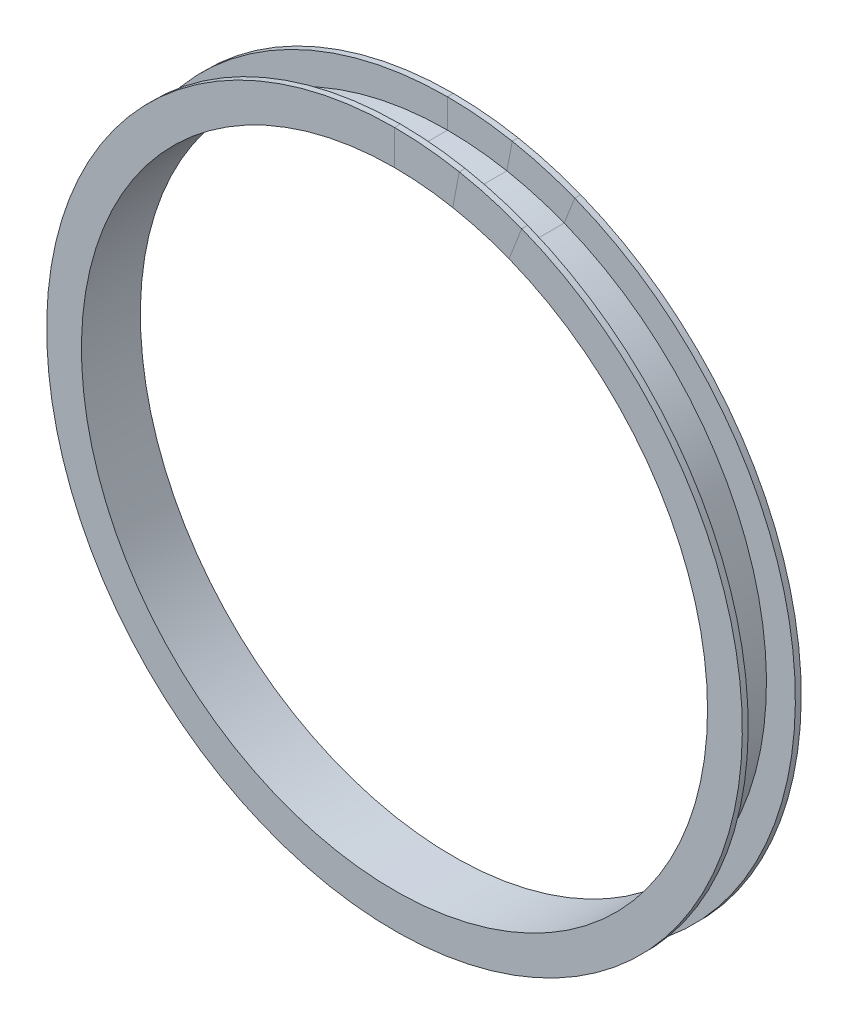
ISO-10303-21;
HEADER;
FILE_DESCRIPTION(('STEP AP214'),'2;1');
FILE_NAME('part.step','',(''),(''),'','','');
FILE_SCHEMA(('AUTOMOTIVE_DESIGN { 1 0 10303 214 1 1 1 1 }'));
ENDSEC;
DATA;
#1=APPLICATION_CONTEXT('core data for automotive mechanical design processes');
#2=APPLICATION_PROTOCOL_DEFINITION('international standard','automotive_design',2000,#1);
#3=PRODUCT_CONTEXT('',#1,'mechanical');
#4=PRODUCT('Part','Part','',(#3));
#5=PRODUCT_RELATED_PRODUCT_CATEGORY('part','',(#4));
#6=PRODUCT_DEFINITION_FORMATION('','',#4);
#7=PRODUCT_DEFINITION_CONTEXT('part definition',#1,'design');
#8=PRODUCT_DEFINITION('design','',#6,#7);
#9=PRODUCT_DEFINITION_SHAPE('','',#8);
#10=(LENGTH_UNIT() NAMED_UNIT(*) SI_UNIT(.MILLI.,.METRE.));
#11=(NAMED_UNIT(*) PLANE_ANGLE_UNIT() SI_UNIT($,.RADIAN.));
#12=(NAMED_UNIT(*) SI_UNIT($,.STERADIAN.) SOLID_ANGLE_UNIT());
#13=UNCERTAINTY_MEASURE_WITH_UNIT(LENGTH_MEASURE(1.E-05),#10,'distance_accuracy_value','');
#14=(GEOMETRIC_REPRESENTATION_CONTEXT(3) GLOBAL_UNCERTAINTY_ASSIGNED_CONTEXT((#13)) GLOBAL_UNIT_ASSIGNED_CONTEXT((#10,
#11,#12)) REPRESENTATION_CONTEXT('',''));
#15=CARTESIAN_POINT('',(0.,0.,0.));
#16=DIRECTION('',(0.,0.,1.));
#17=DIRECTION('',(1.,0.,0.));
#18=AXIS2_PLACEMENT_3D('',#15,#16,#17);
#19=CARTESIAN_POINT('',(0.,49.6794513874194,-0.01));
#20=DIRECTION('',(1.,0.,0.));
#21=DIRECTION('',(0.,1.,0.));
#22=AXIS2_PLACEMENT_3D('',#19,#20,#21);
#23=PLANE('',#22);
#24=DIRECTION('',(0.,0.,-1.));
#25=VECTOR('',#24,1.);
#26=CARTESIAN_POINT('',(0.,168.656,3.175));
#27=LINE('',#26,#25);
#28=CARTESIAN_POINT('',(0.,168.656,0.));
#29=VERTEX_POINT('',#28);
#30=CARTESIAN_POINT('',(0.,168.656,31.75));
#31=VERTEX_POINT('',#30);
#32=EDGE_CURVE('E154',#29,#31,#27,.F.);
#33=ORIENTED_EDGE('',*,*,#32,.T.);
#34=DIRECTION('',(0.,1.,0.));
#35=VECTOR('',#34,1.);
#36=CARTESIAN_POINT('',(0.,0.,31.75));
#37=LINE('',#36,#35);
#38=CARTESIAN_POINT('',(0.,187.3885,31.75));
#39=VERTEX_POINT('',#38);
#40=EDGE_CURVE('E50',#31,#39,#37,.T.);
#41=ORIENTED_EDGE('',*,*,#40,.T.);
#42=DIRECTION('',(0.,0.,-1.));
#43=VECTOR('',#42,1.);
#44=CARTESIAN_POINT('',(0.,187.3885,31.75));
#45=LINE('',#44,#43);
#46=CARTESIAN_POINT('',(0.,187.3885,28.575));
#47=VERTEX_POINT('',#46);
#48=EDGE_CURVE('E63',#47,#39,#45,.F.);
#49=ORIENTED_EDGE('',*,*,#48,.F.);
#50=DIRECTION('',(0.,1.,0.));
#51=VECTOR('',#50,1.);
#52=CARTESIAN_POINT('',(0.,0.,28.575));
#53=LINE('',#52,#51);
#54=CARTESIAN_POINT('',(0.,171.831,28.575));
#55=VERTEX_POINT('',#54);
#56=EDGE_CURVE('E71',#55,#47,#53,.T.);
#57=ORIENTED_EDGE('',*,*,#56,.F.);
#58=DIRECTION('',(0.,0.,-1.));
#59=VECTOR('',#58,1.);
#60=CARTESIAN_POINT('',(0.,171.831,28.575));
#61=LINE('',#60,#59);
#62=CARTESIAN_POINT('',(0.,171.831,3.175));
#63=VERTEX_POINT('',#62);
#64=EDGE_CURVE('E125',#63,#55,#61,.F.);
#65=ORIENTED_EDGE('',*,*,#64,.F.);
#66=DIRECTION('',(0.,1.,0.));
#67=VECTOR('',#66,1.);
#68=CARTESIAN_POINT('',(0.,0.,3.175));
#69=LINE('',#68,#67);
#70=CARTESIAN_POINT('',(0.,187.3885,3.175));
#71=VERTEX_POINT('',#70);
#72=EDGE_CURVE('E150',#63,#71,#69,.T.);
#73=ORIENTED_EDGE('',*,*,#72,.T.);
#74=DIRECTION('',(0.,0.,-1.));
#75=VECTOR('',#74,1.);
#76=CARTESIAN_POINT('',(0.,187.3885,3.175));
#77=LINE('',#76,#75);
#78=CARTESIAN_POINT('',(0.,187.3885,0.));
#79=VERTEX_POINT('',#78);
#80=EDGE_CURVE('E171',#79,#71,#77,.F.);
#81=ORIENTED_EDGE('',*,*,#80,.F.);
#82=DIRECTION('',(0.,1.,0.));
#83=VECTOR('',#82,1.);
#84=CARTESIAN_POINT('',(0.,0.,0.));
#85=LINE('',#84,#83);
#86=EDGE_CURVE('E169',#29,#79,#85,.T.);
#87=ORIENTED_EDGE('',*,*,#86,.F.);
#88=EDGE_LOOP('',(#33,#41,#49,#57,#65,#73,#81,#87));
#89=FACE_BOUND('',#88,.T.);
#90=ADVANCED_FACE('F46',(#89),#23,.F.);
#91=CARTESIAN_POINT('',(9.24937415001116,48.8108283886688,-0.01));
#92=DIRECTION('',(0.982515447041136,-0.186181084768449,0.));
#93=DIRECTION('',(0.186181084768449,0.982515447041136,0.));
#94=AXIS2_PLACEMENT_3D('',#91,#92,#93);
#95=PLANE('',#94);
#96=DIRECTION('',(0.,0.,-1.));
#97=VECTOR('',#96,1.);
#98=CARTESIAN_POINT('',(31.4005570327075,165.70712523617,3.175));
#99=LINE('',#98,#97);
#100=CARTESIAN_POINT('',(31.4005570327075,165.70712523617,0.));
#101=VERTEX_POINT('',#100);
#102=CARTESIAN_POINT('',(31.4005570327075,165.70712523617,31.75));
#103=VERTEX_POINT('',#102);
#104=EDGE_CURVE('E170',#101,#103,#99,.F.);
#105=ORIENTED_EDGE('',*,*,#104,.F.);
#106=DIRECTION('',(0.186181084768449,0.982515447041136,0.));
#107=VECTOR('',#106,1.);
#108=CARTESIAN_POINT('',(0.,0.,0.));
#109=LINE('',#108,#107);
#110=CARTESIAN_POINT('',(34.8881942031324,184.112095847868,0.));
#111=VERTEX_POINT('',#110);
#112=EDGE_CURVE('E153',#101,#111,#109,.T.);
#113=ORIENTED_EDGE('',*,*,#112,.T.);
#114=DIRECTION('',(0.,0.,-1.));
#115=VECTOR('',#114,1.);
#116=CARTESIAN_POINT('',(34.8881942031324,184.112095847868,3.175));
#117=LINE('',#116,#115);
#118=CARTESIAN_POINT('',(34.8881942031324,184.112095847868,3.175));
#119=VERTEX_POINT('',#118);
#120=EDGE_CURVE('E156',#111,#119,#117,.F.);
#121=ORIENTED_EDGE('',*,*,#120,.T.);
#122=DIRECTION('',(0.186181084768449,0.982515447041136,0.));
#123=VECTOR('',#122,1.);
#124=CARTESIAN_POINT('',(0.,0.,3.175));
#125=LINE('',#124,#123);
#126=CARTESIAN_POINT('',(31.9916819768473,168.826611780525,3.175));
#127=VERTEX_POINT('',#126);
#128=EDGE_CURVE('E152',#127,#119,#125,.T.);
#129=ORIENTED_EDGE('',*,*,#128,.F.);
#130=DIRECTION('',(0.,0.,-1.));
#131=VECTOR('',#130,1.);
#132=CARTESIAN_POINT('',(31.9916819768473,168.826611780525,28.575));
#133=LINE('',#132,#131);
#134=CARTESIAN_POINT('',(31.9916819768473,168.826611780526,28.575));
#135=VERTEX_POINT('',#134);
#136=EDGE_CURVE('E157',#127,#135,#133,.F.);
#137=ORIENTED_EDGE('',*,*,#136,.T.);
#138=DIRECTION('',(0.186181084768449,0.982515447041136,0.));
#139=VECTOR('',#138,1.);
#140=CARTESIAN_POINT('',(0.,0.,28.575));
#141=LINE('',#140,#139);
#142=CARTESIAN_POINT('',(34.8881942031324,184.112095847868,28.575));
#143=VERTEX_POINT('',#142);
#144=EDGE_CURVE('E131',#135,#143,#141,.T.);
#145=ORIENTED_EDGE('',*,*,#144,.T.);
#146=DIRECTION('',(0.,0.,-1.));
#147=VECTOR('',#146,1.);
#148=CARTESIAN_POINT('',(34.8881942031324,184.112095847868,31.75));
#149=LINE('',#148,#147);
#150=CARTESIAN_POINT('',(34.8881942031324,184.112095847868,31.75));
#151=VERTEX_POINT('',#150);
#152=EDGE_CURVE('E116',#143,#151,#149,.F.);
#153=ORIENTED_EDGE('',*,*,#152,.T.);
#154=DIRECTION('',(0.186181084768449,0.982515447041136,0.));
#155=VECTOR('',#154,1.);
#156=CARTESIAN_POINT('',(0.,0.,31.75));
#157=LINE('',#156,#155);
#158=EDGE_CURVE('E121',#103,#151,#157,.T.);
#159=ORIENTED_EDGE('',*,*,#158,.F.);
#160=EDGE_LOOP('',(#105,#113,#121,#129,#137,#145,#153,#159));
#161=FACE_BOUND('',#160,.T.);
#162=ADVANCED_FACE('F128',(#161),#95,.T.);
#163=CARTESIAN_POINT('',(0.,0.,3.175));
#164=DIRECTION('',(0.,0.,1.));
#165=DIRECTION('',(1.,0.,0.));
#166=AXIS2_PLACEMENT_3D('',#163,#164,#165);
#167=PLANE('',#166);
#168=ORIENTED_EDGE('',*,*,#72,.F.);
#169=CARTESIAN_POINT('',(0.,0.,3.175));
#170=DIRECTION('',(0.,0.,1.));
#171=DIRECTION('',(1.,0.,0.));
#172=AXIS2_PLACEMENT_3D('',#169,#170,#171);
#173=CIRCLE('',#172,171.831);
#174=EDGE_CURVE('E118',#127,#63,#173,.T.);
#175=ORIENTED_EDGE('',*,*,#174,.F.);
#176=ORIENTED_EDGE('',*,*,#128,.T.);
#177=CARTESIAN_POINT('',(0.,0.,3.175));
#178=DIRECTION('',(0.,0.,1.));
#179=DIRECTION('',(1.,0.,0.));
#180=AXIS2_PLACEMENT_3D('',#177,#178,#179);
#181=CIRCLE('',#180,187.3885);
#182=EDGE_CURVE('E147',#119,#71,#181,.T.);
#183=ORIENTED_EDGE('',*,*,#182,.T.);
#184=EDGE_LOOP('',(#168,#175,#176,#183));
#185=FACE_BOUND('',#184,.T.);
#186=ADVANCED_FACE('F203',(#185),#167,.T.);
#187=CARTESIAN_POINT('',(0.,0.,0.));
#188=DIRECTION('',(0.,0.,1.));
#189=DIRECTION('',(1.,0.,0.));
#190=AXIS2_PLACEMENT_3D('',#187,#188,#189);
#191=PLANE('',#190);
#192=CARTESIAN_POINT('',(0.,0.,0.));
#193=DIRECTION('',(0.,0.,1.));
#194=DIRECTION('',(1.,0.,0.));
#195=AXIS2_PLACEMENT_3D('',#192,#193,#194);
#196=CIRCLE('',#195,168.656);
#197=EDGE_CURVE('E141',#101,#29,#196,.T.);
#198=ORIENTED_EDGE('',*,*,#197,.T.);
#199=ORIENTED_EDGE('',*,*,#86,.T.);
#200=CARTESIAN_POINT('',(0.,0.,0.));
#201=DIRECTION('',(0.,0.,1.));
#202=DIRECTION('',(1.,0.,0.));
#203=AXIS2_PLACEMENT_3D('',#200,#201,#202);
#204=CIRCLE('',#203,187.3885);
#205=EDGE_CURVE('E144',#111,#79,#204,.T.);
#206=ORIENTED_EDGE('',*,*,#205,.F.);
#207=ORIENTED_EDGE('',*,*,#112,.F.);
#208=EDGE_LOOP('',(#198,#199,#206,#207));
#209=FACE_BOUND('',#208,.T.);
#210=ADVANCED_FACE('F179',(#209),#191,.F.);
#211=CARTESIAN_POINT('',(0.,0.,3.175));
#212=DIRECTION('',(0.,0.,-1.));
#213=DIRECTION('',(-1.,0.,0.));
#214=AXIS2_PLACEMENT_3D('',#211,#212,#213);
#215=CYLINDRICAL_SURFACE('',#214,187.3885);
#216=ORIENTED_EDGE('',*,*,#205,.T.);
#217=ORIENTED_EDGE('',*,*,#80,.T.);
#218=ORIENTED_EDGE('',*,*,#182,.F.);
#219=ORIENTED_EDGE('',*,*,#120,.F.);
#220=EDGE_LOOP('',(#216,#217,#218,#219));
#221=FACE_BOUND('',#220,.T.);
#222=ADVANCED_FACE('F185',(#221),#215,.T.);
#223=CARTESIAN_POINT('',(0.,0.,3.175));
#224=DIRECTION('',(0.,0.,-1.));
#225=DIRECTION('',(-1.,0.,0.));
#226=AXIS2_PLACEMENT_3D('',#223,#224,#225);
#227=CYLINDRICAL_SURFACE('',#226,168.656);
#228=ORIENTED_EDGE('',*,*,#32,.F.);
#229=ORIENTED_EDGE('',*,*,#197,.F.);
#230=ORIENTED_EDGE('',*,*,#104,.T.);
#231=CARTESIAN_POINT('',(0.,0.,31.75));
#232=DIRECTION('',(0.,0.,1.));
#233=DIRECTION('',(1.,0.,0.));
#234=AXIS2_PLACEMENT_3D('',#231,#232,#233);
#235=CIRCLE('',#234,168.656);
#236=EDGE_CURVE('E12',#103,#31,#235,.T.);
#237=ORIENTED_EDGE('',*,*,#236,.T.);
#238=EDGE_LOOP('',(#228,#229,#230,#237));
#239=FACE_BOUND('',#238,.T.);
#240=ADVANCED_FACE('F187',(#239),#227,.F.);
#241=CARTESIAN_POINT('',(0.,0.,28.575));
#242=DIRECTION('',(0.,0.,-1.));
#243=DIRECTION('',(-1.,0.,0.));
#244=AXIS2_PLACEMENT_3D('',#241,#242,#243);
#245=CYLINDRICAL_SURFACE('',#244,171.831);
#246=ORIENTED_EDGE('',*,*,#174,.T.);
#247=ORIENTED_EDGE('',*,*,#64,.T.);
#248=CARTESIAN_POINT('',(0.,0.,28.575));
#249=DIRECTION('',(0.,0.,1.));
#250=DIRECTION('',(1.,0.,0.));
#251=AXIS2_PLACEMENT_3D('',#248,#249,#250);
#252=CIRCLE('',#251,171.831);
#253=EDGE_CURVE('E139',#135,#55,#252,.T.);
#254=ORIENTED_EDGE('',*,*,#253,.F.);
#255=ORIENTED_EDGE('',*,*,#136,.F.);
#256=EDGE_LOOP('',(#246,#247,#254,#255));
#257=FACE_BOUND('',#256,.T.);
#258=ADVANCED_FACE('F189',(#257),#245,.T.);
#259=CARTESIAN_POINT('',(0.,0.,31.75));
#260=DIRECTION('',(0.,0.,1.));
#261=DIRECTION('',(1.,0.,0.));
#262=AXIS2_PLACEMENT_3D('',#259,#260,#261);
#263=PLANE('',#262);
#264=ORIENTED_EDGE('',*,*,#40,.F.);
#265=ORIENTED_EDGE('',*,*,#236,.F.);
#266=ORIENTED_EDGE('',*,*,#158,.T.);
#267=CARTESIAN_POINT('',(0.,0.,31.75));
#268=DIRECTION('',(0.,0.,1.));
#269=DIRECTION('',(1.,0.,0.));
#270=AXIS2_PLACEMENT_3D('',#267,#268,#269);
#271=CIRCLE('',#270,187.3885);
#272=EDGE_CURVE('E113',#151,#39,#271,.T.);
#273=ORIENTED_EDGE('',*,*,#272,.T.);
#274=EDGE_LOOP('',(#264,#265,#266,#273));
#275=FACE_BOUND('',#274,.T.);
#276=ADVANCED_FACE('F122',(#275),#263,.T.);
#277=CARTESIAN_POINT('',(0.,0.,28.575));
#278=DIRECTION('',(0.,0.,1.));
#279=DIRECTION('',(1.,0.,0.));
#280=AXIS2_PLACEMENT_3D('',#277,#278,#279);
#281=PLANE('',#280);
#282=ORIENTED_EDGE('',*,*,#253,.T.);
#283=ORIENTED_EDGE('',*,*,#56,.T.);
#284=CARTESIAN_POINT('',(0.,0.,28.575));
#285=DIRECTION('',(0.,0.,1.));
#286=DIRECTION('',(1.,0.,0.));
#287=AXIS2_PLACEMENT_3D('',#284,#285,#286);
#288=CIRCLE('',#287,187.3885);
#289=EDGE_CURVE('E55',#143,#47,#288,.T.);
#290=ORIENTED_EDGE('',*,*,#289,.F.);
#291=ORIENTED_EDGE('',*,*,#144,.F.);
#292=EDGE_LOOP('',(#282,#283,#290,#291));
#293=FACE_BOUND('',#292,.T.);
#294=ADVANCED_FACE('F239',(#293),#281,.F.);
#295=CARTESIAN_POINT('',(0.,0.,31.75));
#296=DIRECTION('',(0.,0.,-1.));
#297=DIRECTION('',(-1.,0.,0.));
#298=AXIS2_PLACEMENT_3D('',#295,#296,#297);
#299=CYLINDRICAL_SURFACE('',#298,187.3885);
#300=ORIENTED_EDGE('',*,*,#289,.T.);
#301=ORIENTED_EDGE('',*,*,#48,.T.);
#302=ORIENTED_EDGE('',*,*,#272,.F.);
#303=ORIENTED_EDGE('',*,*,#152,.F.);
#304=EDGE_LOOP('',(#300,#301,#302,#303));
#305=FACE_BOUND('',#304,.T.);
#306=ADVANCED_FACE('F48',(#305),#299,.T.);
#307=CLOSED_SHELL('',(#90,#162,#186,#210,#222,#240,#258,#276,#294,#306));
#308=MANIFOLD_SOLID_BREP('B2',#307);
#309=CARTESIAN_POINT('',(18.1753059556979,46.2353343620628,-0.01));
#310=DIRECTION('',(0.930673207348878,-0.365851583463775,0.));
#311=DIRECTION('',(0.365851583463775,0.930673207348878,0.));
#312=AXIS2_PLACEMENT_3D('',#309,#310,#311);
#313=PLANE('',#312);
#314=DIRECTION('',(0.,0.,-1.));
#315=VECTOR('',#314,1.);
#316=CARTESIAN_POINT('',(61.7030646606653,156.963620458633,3.175));
#317=LINE('',#316,#315);
#318=CARTESIAN_POINT('',(61.7030646606653,156.963620458633,0.));
#319=VERTEX_POINT('',#318);
#320=CARTESIAN_POINT('',(61.7030646606653,156.963620458633,31.75));
#321=VERTEX_POINT('',#320);
#322=EDGE_CURVE('E382',#319,#321,#317,.F.);
#323=ORIENTED_EDGE('',*,*,#322,.T.);
#324=DIRECTION('',(0.365851583463775,0.930673207348878,0.));
#325=VECTOR('',#324,1.);
#326=CARTESIAN_POINT('',(-1.15918275477802E-12,4.55679655340572E-13,31.75));
#327=LINE('',#326,#325);
#328=CARTESIAN_POINT('',(68.5563794479005,174.397456315296,31.75));
#329=VERTEX_POINT('',#328);
#330=EDGE_CURVE('E374',#321,#329,#327,.T.);
#331=ORIENTED_EDGE('',*,*,#330,.T.);
#332=DIRECTION('',(0.,0.,-1.));
#333=VECTOR('',#332,1.);
#334=CARTESIAN_POINT('',(68.5563794479005,174.397456315296,31.75));
#335=LINE('',#334,#333);
#336=CARTESIAN_POINT('',(68.5563794479005,174.397456315296,28.575));
#337=VERTEX_POINT('',#336);
#338=EDGE_CURVE('E306',#337,#329,#335,.F.);
#339=ORIENTED_EDGE('',*,*,#338,.F.);
#340=DIRECTION('',(0.365851583463775,0.930673207348878,0.));
#341=VECTOR('',#340,1.);
#342=CARTESIAN_POINT('',(-1.15918275477802E-12,4.55679655340572E-13,28.575));
#343=LINE('',#342,#341);
#344=CARTESIAN_POINT('',(62.8646434381628,159.918507891966,28.575));
#345=VERTEX_POINT('',#344);
#346=EDGE_CURVE('E314',#345,#337,#343,.T.);
#347=ORIENTED_EDGE('',*,*,#346,.F.);
#348=DIRECTION('',(0.,0.,-1.));
#349=VECTOR('',#348,1.);
#350=CARTESIAN_POINT('',(62.8646434381628,159.918507891966,28.575));
#351=LINE('',#350,#349);
#352=CARTESIAN_POINT('',(62.8646434381628,159.918507891966,3.175));
#353=VERTEX_POINT('',#352);
#354=EDGE_CURVE('E367',#353,#345,#351,.F.);
#355=ORIENTED_EDGE('',*,*,#354,.F.);
#356=DIRECTION('',(0.365851583463775,0.930673207348878,0.));
#357=VECTOR('',#356,1.);
#358=CARTESIAN_POINT('',(-1.15918275477802E-12,4.55679655340572E-13,3.175));
#359=LINE('',#358,#357);
#360=CARTESIAN_POINT('',(68.5563794479005,174.397456315296,3.175));
#361=VERTEX_POINT('',#360);
#362=EDGE_CURVE('E389',#353,#361,#359,.T.);
#363=ORIENTED_EDGE('',*,*,#362,.T.);
#364=DIRECTION('',(0.,0.,-1.));
#365=VECTOR('',#364,1.);
#366=CARTESIAN_POINT('',(68.5563794479005,174.397456315296,3.175));
#367=LINE('',#366,#365);
#368=CARTESIAN_POINT('',(68.5563794479005,174.397456315296,0.));
#369=VERTEX_POINT('',#368);
#370=EDGE_CURVE('E394',#369,#361,#367,.F.);
#371=ORIENTED_EDGE('',*,*,#370,.F.);
#372=DIRECTION('',(0.365851583463775,0.930673207348878,0.));
#373=VECTOR('',#372,1.);
#374=CARTESIAN_POINT('',(-1.15918275477802E-12,4.55679655340572E-13,0.));
#375=LINE('',#374,#373);
#376=EDGE_CURVE('E392',#319,#369,#375,.T.);
#377=ORIENTED_EDGE('',*,*,#376,.F.);
#378=EDGE_LOOP('',(#323,#331,#339,#347,#355,#363,#371,#377));
#379=FACE_BOUND('',#378,.T.);
#380=ADVANCED_FACE('F289',(#379),#313,.F.);
#381=CARTESIAN_POINT('',(0.,49.6794513874194,-0.01));
#382=DIRECTION('',(1.,0.,0.));
#383=DIRECTION('',(0.,1.,0.));
#384=AXIS2_PLACEMENT_3D('',#381,#382,#383);
#385=PLANE('',#384);
#386=DIRECTION('',(0.,0.,-1.));
#387=VECTOR('',#386,1.);
#388=CARTESIAN_POINT('',(0.,168.656,3.175));
#389=LINE('',#388,#387);
#390=CARTESIAN_POINT('',(0.,168.656,0.));
#391=VERTEX_POINT('',#390);
#392=CARTESIAN_POINT('',(0.,168.656,31.75));
#393=VERTEX_POINT('',#392);
#394=EDGE_CURVE('E393',#391,#393,#389,.F.);
#395=ORIENTED_EDGE('',*,*,#394,.F.);
#396=DIRECTION('',(0.,1.,0.));
#397=VECTOR('',#396,1.);
#398=CARTESIAN_POINT('',(0.,0.,0.));
#399=LINE('',#398,#397);
#400=CARTESIAN_POINT('',(0.,187.3885,0.));
#401=VERTEX_POINT('',#400);
#402=EDGE_CURVE('E386',#391,#401,#399,.T.);
#403=ORIENTED_EDGE('',*,*,#402,.T.);
#404=DIRECTION('',(0.,0.,-1.));
#405=VECTOR('',#404,1.);
#406=CARTESIAN_POINT('',(0.,187.3885,3.175));
#407=LINE('',#406,#405);
#408=CARTESIAN_POINT('',(0.,187.3885,3.175));
#409=VERTEX_POINT('',#408);
#410=EDGE_CURVE('E383',#401,#409,#407,.F.);
#411=ORIENTED_EDGE('',*,*,#410,.T.);
#412=DIRECTION('',(0.,1.,0.));
#413=VECTOR('',#412,1.);
#414=CARTESIAN_POINT('',(0.,0.,3.175));
#415=LINE('',#414,#413);
#416=CARTESIAN_POINT('',(0.,171.831,3.175));
#417=VERTEX_POINT('',#416);
#418=EDGE_CURVE('E390',#417,#409,#415,.T.);
#419=ORIENTED_EDGE('',*,*,#418,.F.);
#420=DIRECTION('',(0.,0.,-1.));
#421=VECTOR('',#420,1.);
#422=CARTESIAN_POINT('',(0.,171.831,28.575));
#423=LINE('',#422,#421);
#424=CARTESIAN_POINT('',(0.,171.831,28.575));
#425=VERTEX_POINT('',#424);
#426=EDGE_CURVE('E380',#417,#425,#423,.F.);
#427=ORIENTED_EDGE('',*,*,#426,.T.);
#428=DIRECTION('',(0.,1.,0.));
#429=VECTOR('',#428,1.);
#430=CARTESIAN_POINT('',(0.,0.,28.575));
#431=LINE('',#430,#429);
#432=CARTESIAN_POINT('',(0.,187.3885,28.575));
#433=VERTEX_POINT('',#432);
#434=EDGE_CURVE('E372',#425,#433,#431,.T.);
#435=ORIENTED_EDGE('',*,*,#434,.T.);
#436=DIRECTION('',(0.,0.,-1.));
#437=VECTOR('',#436,1.);
#438=CARTESIAN_POINT('',(0.,187.3885,31.75));
#439=LINE('',#438,#437);
#440=CARTESIAN_POINT('',(0.,187.3885,31.75));
#441=VERTEX_POINT('',#440);
#442=EDGE_CURVE('E359',#433,#441,#439,.F.);
#443=ORIENTED_EDGE('',*,*,#442,.T.);
#444=DIRECTION('',(0.,1.,0.));
#445=VECTOR('',#444,1.);
#446=CARTESIAN_POINT('',(0.,0.,31.75));
#447=LINE('',#446,#445);
#448=EDGE_CURVE('E293',#393,#441,#447,.T.);
#449=ORIENTED_EDGE('',*,*,#448,.F.);
#450=EDGE_LOOP('',(#395,#403,#411,#419,#427,#435,#443,#449));
#451=FACE_BOUND('',#450,.T.);
#452=ADVANCED_FACE('F369',(#451),#385,.T.);
#453=CARTESIAN_POINT('',(0.,0.,0.));
#454=DIRECTION('',(0.,0.,1.));
#455=DIRECTION('',(1.,0.,0.));
#456=AXIS2_PLACEMENT_3D('',#453,#454,#455);
#457=PLANE('',#456);
#458=ORIENTED_EDGE('',*,*,#402,.F.);
#459=CARTESIAN_POINT('',(0.,0.,0.));
#460=DIRECTION('',(0.,0.,1.));
#461=DIRECTION('',(1.,0.,0.));
#462=AXIS2_PLACEMENT_3D('',#459,#460,#461);
#463=CIRCLE('',#462,168.656);
#464=EDGE_CURVE('E415',#391,#319,#463,.T.);
#465=ORIENTED_EDGE('',*,*,#464,.T.);
#466=ORIENTED_EDGE('',*,*,#376,.T.);
#467=CARTESIAN_POINT('',(0.,0.,0.));
#468=DIRECTION('',(0.,0.,1.));
#469=DIRECTION('',(1.,0.,0.));
#470=AXIS2_PLACEMENT_3D('',#467,#468,#469);
#471=CIRCLE('',#470,187.3885);
#472=EDGE_CURVE('E417',#401,#369,#471,.T.);
#473=ORIENTED_EDGE('',*,*,#472,.F.);
#474=EDGE_LOOP('',(#458,#465,#466,#473));
#475=FACE_BOUND('',#474,.T.);
#476=ADVANCED_FACE('F429',(#475),#457,.F.);
#477=CARTESIAN_POINT('',(0.,0.,3.175));
#478=DIRECTION('',(0.,0.,1.));
#479=DIRECTION('',(1.,0.,0.));
#480=AXIS2_PLACEMENT_3D('',#477,#478,#479);
#481=PLANE('',#480);
#482=CARTESIAN_POINT('',(0.,0.,3.175));
#483=DIRECTION('',(0.,0.,1.));
#484=DIRECTION('',(1.,0.,0.));
#485=AXIS2_PLACEMENT_3D('',#482,#483,#484);
#486=CIRCLE('',#485,171.831);
#487=EDGE_CURVE('E361',#417,#353,#486,.T.);
#488=ORIENTED_EDGE('',*,*,#487,.F.);
#489=ORIENTED_EDGE('',*,*,#418,.T.);
#490=CARTESIAN_POINT('',(0.,0.,3.175));
#491=DIRECTION('',(0.,0.,1.));
#492=DIRECTION('',(1.,0.,0.));
#493=AXIS2_PLACEMENT_3D('',#490,#491,#492);
#494=CIRCLE('',#493,187.3885);
#495=EDGE_CURVE('E377',#409,#361,#494,.T.);
#496=ORIENTED_EDGE('',*,*,#495,.T.);
#497=ORIENTED_EDGE('',*,*,#362,.F.);
#498=EDGE_LOOP('',(#488,#489,#496,#497));
#499=FACE_BOUND('',#498,.T.);
#500=ADVANCED_FACE('F422',(#499),#481,.T.);
#501=CARTESIAN_POINT('',(0.,0.,3.175));
#502=DIRECTION('',(0.,0.,-1.));
#503=DIRECTION('',(-1.,0.,0.));
#504=AXIS2_PLACEMENT_3D('',#501,#502,#503);
#505=CYLINDRICAL_SURFACE('',#504,168.656);
#506=ORIENTED_EDGE('',*,*,#464,.F.);
#507=ORIENTED_EDGE('',*,*,#394,.T.);
#508=CARTESIAN_POINT('',(0.,0.,31.75));
#509=DIRECTION('',(0.,0.,1.));
#510=DIRECTION('',(1.,0.,0.));
#511=AXIS2_PLACEMENT_3D('',#508,#509,#510);
#512=CIRCLE('',#511,168.656);
#513=EDGE_CURVE('E44',#393,#321,#512,.T.);
#514=ORIENTED_EDGE('',*,*,#513,.T.);
#515=ORIENTED_EDGE('',*,*,#322,.F.);
#516=EDGE_LOOP('',(#506,#507,#514,#515));
#517=FACE_BOUND('',#516,.T.);
#518=ADVANCED_FACE('F431',(#517),#505,.F.);
#519=CARTESIAN_POINT('',(0.,0.,28.575));
#520=DIRECTION('',(0.,0.,-1.));
#521=DIRECTION('',(-1.,0.,0.));
#522=AXIS2_PLACEMENT_3D('',#519,#520,#521);
#523=CYLINDRICAL_SURFACE('',#522,171.831);
#524=ORIENTED_EDGE('',*,*,#426,.F.);
#525=ORIENTED_EDGE('',*,*,#487,.T.);
#526=ORIENTED_EDGE('',*,*,#354,.T.);
#527=CARTESIAN_POINT('',(0.,0.,28.575));
#528=DIRECTION('',(0.,0.,1.));
#529=DIRECTION('',(1.,0.,0.));
#530=AXIS2_PLACEMENT_3D('',#527,#528,#529);
#531=CIRCLE('',#530,171.831);
#532=EDGE_CURVE('E413',#425,#345,#531,.T.);
#533=ORIENTED_EDGE('',*,*,#532,.F.);
#534=EDGE_LOOP('',(#524,#525,#526,#533));
#535=FACE_BOUND('',#534,.T.);
#536=ADVANCED_FACE('F434',(#535),#523,.T.);
#537=CARTESIAN_POINT('',(0.,0.,31.75));
#538=DIRECTION('',(0.,0.,1.));
#539=DIRECTION('',(1.,0.,0.));
#540=AXIS2_PLACEMENT_3D('',#537,#538,#539);
#541=PLANE('',#540);
#542=ORIENTED_EDGE('',*,*,#513,.F.);
#543=ORIENTED_EDGE('',*,*,#448,.T.);
#544=CARTESIAN_POINT('',(0.,0.,31.75));
#545=DIRECTION('',(0.,0.,1.));
#546=DIRECTION('',(1.,0.,0.));
#547=AXIS2_PLACEMENT_3D('',#544,#545,#546);
#548=CIRCLE('',#547,187.3885);
#549=EDGE_CURVE('E356',#441,#329,#548,.T.);
#550=ORIENTED_EDGE('',*,*,#549,.T.);
#551=ORIENTED_EDGE('',*,*,#330,.F.);
#552=EDGE_LOOP('',(#542,#543,#550,#551));
#553=FACE_BOUND('',#552,.T.);
#554=ADVANCED_FACE('F364',(#553),#541,.T.);
#555=CARTESIAN_POINT('',(0.,0.,28.575));
#556=DIRECTION('',(0.,0.,1.));
#557=DIRECTION('',(1.,0.,0.));
#558=AXIS2_PLACEMENT_3D('',#555,#556,#557);
#559=PLANE('',#558);
#560=ORIENTED_EDGE('',*,*,#434,.F.);
#561=ORIENTED_EDGE('',*,*,#532,.T.);
#562=ORIENTED_EDGE('',*,*,#346,.T.);
#563=CARTESIAN_POINT('',(0.,0.,28.575));
#564=DIRECTION('',(0.,0.,1.));
#565=DIRECTION('',(1.,0.,0.));
#566=AXIS2_PLACEMENT_3D('',#563,#564,#565);
#567=CIRCLE('',#566,187.3885);
#568=EDGE_CURVE('E298',#433,#337,#567,.T.);
#569=ORIENTED_EDGE('',*,*,#568,.F.);
#570=EDGE_LOOP('',(#560,#561,#562,#569));
#571=FACE_BOUND('',#570,.T.);
#572=ADVANCED_FACE('F435',(#571),#559,.F.);
#573=CARTESIAN_POINT('',(0.,0.,31.75));
#574=DIRECTION('',(0.,0.,-1.));
#575=DIRECTION('',(-1.,0.,0.));
#576=AXIS2_PLACEMENT_3D('',#573,#574,#575);
#577=CYLINDRICAL_SURFACE('',#576,187.3885);
#578=ORIENTED_EDGE('',*,*,#442,.F.);
#579=ORIENTED_EDGE('',*,*,#568,.T.);
#580=ORIENTED_EDGE('',*,*,#338,.T.);
#581=ORIENTED_EDGE('',*,*,#549,.F.);
#582=EDGE_LOOP('',(#578,#579,#580,#581));
#583=FACE_BOUND('',#582,.T.);
#584=ADVANCED_FACE('F291',(#583),#577,.T.);
#585=CARTESIAN_POINT('',(0.,0.,3.175));
#586=DIRECTION('',(0.,0.,-1.));
#587=DIRECTION('',(-1.,0.,0.));
#588=AXIS2_PLACEMENT_3D('',#585,#586,#587);
#589=CYLINDRICAL_SURFACE('',#588,187.3885);
#590=ORIENTED_EDGE('',*,*,#410,.F.);
#591=ORIENTED_EDGE('',*,*,#472,.T.);
#592=ORIENTED_EDGE('',*,*,#370,.T.);
#593=ORIENTED_EDGE('',*,*,#495,.F.);
#594=EDGE_LOOP('',(#590,#591,#592,#593));
#595=FACE_BOUND('',#594,.T.);
#596=ADVANCED_FACE('F425',(#595),#589,.T.);
#597=CLOSED_SHELL('',(#380,#452,#476,#500,#518,#536,#554,#572,#584,#596));
#598=MANIFOLD_SOLID_BREP('B6',#597);
#599=CARTESIAN_POINT('',(9.24937415001116,48.8108283886688,-0.01));
#600=DIRECTION('',(0.982515447041136,-0.186181084768449,0.));
#601=DIRECTION('',(0.186181084768449,0.982515447041136,0.));
#602=AXIS2_PLACEMENT_3D('',#599,#600,#601);
#603=PLANE('',#602);
#604=DIRECTION('',(0.,0.,-1.));
#605=VECTOR('',#604,1.);
#606=CARTESIAN_POINT('',(31.4005570327075,165.70712523617,3.175));
#607=LINE('',#606,#605);
#608=CARTESIAN_POINT('',(31.4005570327075,165.70712523617,0.));
#609=VERTEX_POINT('',#608);
#610=CARTESIAN_POINT('',(31.4005570327075,165.70712523617,31.75));
#611=VERTEX_POINT('',#610);
#612=EDGE_CURVE('E527',#609,#611,#607,.F.);
#613=ORIENTED_EDGE('',*,*,#612,.T.);
#614=DIRECTION('',(0.186181084768449,0.982515447041136,0.));
#615=VECTOR('',#614,1.);
#616=CARTESIAN_POINT('',(0.,0.,31.75));
#617=LINE('',#616,#615);
#618=CARTESIAN_POINT('',(34.8881942031324,184.112095847868,31.75));
#619=VERTEX_POINT('',#618);
#620=EDGE_CURVE('E599',#611,#619,#617,.T.);
#621=ORIENTED_EDGE('',*,*,#620,.T.);
#622=DIRECTION('',(0.,0.,-1.));
#623=VECTOR('',#622,1.);
#624=CARTESIAN_POINT('',(34.8881942031324,184.112095847868,31.75));
#625=LINE('',#624,#623);
#626=CARTESIAN_POINT('',(34.8881942031324,184.112095847868,28.575));
#627=VERTEX_POINT('',#626);
#628=EDGE_CURVE('E590',#627,#619,#625,.F.);
#629=ORIENTED_EDGE('',*,*,#628,.F.);
#630=DIRECTION('',(0.186181084768449,0.982515447041136,0.));
#631=VECTOR('',#630,1.);
#632=CARTESIAN_POINT('',(0.,0.,28.575));
#633=LINE('',#632,#631);
#634=CARTESIAN_POINT('',(31.9916819768473,168.826611780526,28.575));
#635=VERTEX_POINT('',#634);
#636=EDGE_CURVE('E595',#635,#627,#633,.T.);
#637=ORIENTED_EDGE('',*,*,#636,.F.);
#638=DIRECTION('',(0.,0.,-1.));
#639=VECTOR('',#638,1.);
#640=CARTESIAN_POINT('',(31.9916819768473,168.826611780525,28.575));
#641=LINE('',#640,#639);
#642=CARTESIAN_POINT('',(31.9916819768473,168.826611780525,3.175));
#643=VERTEX_POINT('',#642);
#644=EDGE_CURVE('E627',#643,#635,#641,.F.);
#645=ORIENTED_EDGE('',*,*,#644,.F.);
#646=DIRECTION('',(0.186181084768449,0.982515447041136,0.));
#647=VECTOR('',#646,1.);
#648=CARTESIAN_POINT('',(0.,0.,3.175));
#649=LINE('',#648,#647);
#650=CARTESIAN_POINT('',(34.8881942031324,184.112095847868,3.175));
#651=VERTEX_POINT('',#650);
#652=EDGE_CURVE('E635',#643,#651,#649,.T.);
#653=ORIENTED_EDGE('',*,*,#652,.T.);
#654=DIRECTION('',(0.,0.,-1.));
#655=VECTOR('',#654,1.);
#656=CARTESIAN_POINT('',(34.8881942031324,184.112095847868,3.175));
#657=LINE('',#656,#655);
#658=CARTESIAN_POINT('',(34.8881942031324,184.112095847868,0.));
#659=VERTEX_POINT('',#658);
#660=EDGE_CURVE('E646',#659,#651,#657,.F.);
#661=ORIENTED_EDGE('',*,*,#660,.F.);
#662=DIRECTION('',(0.186181084768449,0.982515447041136,0.));
#663=VECTOR('',#662,1.);
#664=CARTESIAN_POINT('',(0.,0.,0.));
#665=LINE('',#664,#663);
#666=EDGE_CURVE('E636',#609,#659,#665,.T.);
#667=ORIENTED_EDGE('',*,*,#666,.F.);
#668=EDGE_LOOP('',(#613,#621,#629,#637,#645,#653,#661,#667));
#669=FACE_BOUND('',#668,.T.);
#670=ADVANCED_FACE('F523',(#669),#603,.F.);
#671=CARTESIAN_POINT('',(18.1753059556979,46.2353343620628,-0.01));
#672=DIRECTION('',(0.930673207348878,-0.365851583463775,0.));
#673=DIRECTION('',(0.365851583463775,0.930673207348878,0.));
#674=AXIS2_PLACEMENT_3D('',#671,#672,#673);
#675=PLANE('',#674);
#676=DIRECTION('',(0.,0.,-1.));
#677=VECTOR('',#676,1.);
#678=CARTESIAN_POINT('',(61.7030646606653,156.963620458633,3.175));
#679=LINE('',#678,#677);
#680=CARTESIAN_POINT('',(61.7030646606653,156.963620458633,0.));
#681=VERTEX_POINT('',#680);
#682=CARTESIAN_POINT('',(61.7030646606653,156.963620458633,31.75));
#683=VERTEX_POINT('',#682);
#684=EDGE_CURVE('E643',#681,#683,#679,.F.);
#685=ORIENTED_EDGE('',*,*,#684,.F.);
#686=DIRECTION('',(0.365851583463775,0.930673207348878,0.));
#687=VECTOR('',#686,1.);
#688=CARTESIAN_POINT('',(-1.15918275477802E-12,4.55679655340572E-13,0.));
#689=LINE('',#688,#687);
#690=CARTESIAN_POINT('',(68.5563794479005,174.397456315296,0.));
#691=VERTEX_POINT('',#690);
#692=EDGE_CURVE('E640',#681,#691,#689,.T.);
#693=ORIENTED_EDGE('',*,*,#692,.T.);
#694=DIRECTION('',(0.,0.,-1.));
#695=VECTOR('',#694,1.);
#696=CARTESIAN_POINT('',(68.5563794479005,174.397456315296,3.175));
#697=LINE('',#696,#695);
#698=CARTESIAN_POINT('',(68.5563794479005,174.397456315296,3.175));
#699=VERTEX_POINT('',#698);
#700=EDGE_CURVE('E637',#691,#699,#697,.F.);
#701=ORIENTED_EDGE('',*,*,#700,.T.);
#702=DIRECTION('',(0.365851583463775,0.930673207348878,0.));
#703=VECTOR('',#702,1.);
#704=CARTESIAN_POINT('',(-1.15918275477802E-12,4.55679655340572E-13,3.175));
#705=LINE('',#704,#703);
#706=CARTESIAN_POINT('',(62.8646434381628,159.918507891966,3.175));
#707=VERTEX_POINT('',#706);
#708=EDGE_CURVE('E632',#707,#699,#705,.T.);
#709=ORIENTED_EDGE('',*,*,#708,.F.);
#710=DIRECTION('',(0.,0.,-1.));
#711=VECTOR('',#710,1.);
#712=CARTESIAN_POINT('',(62.8646434381628,159.918507891966,28.575));
#713=LINE('',#712,#711);
#714=CARTESIAN_POINT('',(62.8646434381628,159.918507891966,28.575));
#715=VERTEX_POINT('',#714);
#716=EDGE_CURVE('E604',#707,#715,#713,.F.);
#717=ORIENTED_EDGE('',*,*,#716,.T.);
#718=DIRECTION('',(0.365851583463775,0.930673207348878,0.));
#719=VECTOR('',#718,1.);
#720=CARTESIAN_POINT('',(-1.15918275477802E-12,4.55679655340572E-13,28.575));
#721=LINE('',#720,#719);
#722=CARTESIAN_POINT('',(68.5563794479005,174.397456315296,28.575));
#723=VERTEX_POINT('',#722);
#724=EDGE_CURVE('E532',#715,#723,#721,.T.);
#725=ORIENTED_EDGE('',*,*,#724,.T.);
#726=DIRECTION('',(0.,0.,-1.));
#727=VECTOR('',#726,1.);
#728=CARTESIAN_POINT('',(68.5563794479005,174.397456315296,31.75));
#729=LINE('',#728,#727);
#730=CARTESIAN_POINT('',(68.5563794479005,174.397456315296,31.75));
#731=VERTEX_POINT('',#730);
#732=EDGE_CURVE('E287',#723,#731,#729,.F.);
#733=ORIENTED_EDGE('',*,*,#732,.T.);
#734=DIRECTION('',(0.365851583463775,0.930673207348878,0.));
#735=VECTOR('',#734,1.);
#736=CARTESIAN_POINT('',(-1.15918275477802E-12,4.55679655340572E-13,31.75));
#737=LINE('',#736,#735);
#738=EDGE_CURVE('E607',#683,#731,#737,.T.);
#739=ORIENTED_EDGE('',*,*,#738,.F.);
#740=EDGE_LOOP('',(#685,#693,#701,#709,#717,#725,#733,#739));
#741=FACE_BOUND('',#740,.T.);
#742=ADVANCED_FACE('F525',(#741),#675,.T.);
#743=CARTESIAN_POINT('',(0.,0.,0.));
#744=DIRECTION('',(0.,0.,1.));
#745=DIRECTION('',(1.,0.,0.));
#746=AXIS2_PLACEMENT_3D('',#743,#744,#745);
#747=PLANE('',#746);
#748=CARTESIAN_POINT('',(0.,0.,0.));
#749=DIRECTION('',(0.,0.,1.));
#750=DIRECTION('',(1.,0.,0.));
#751=AXIS2_PLACEMENT_3D('',#748,#749,#750);
#752=CIRCLE('',#751,168.656);
#753=EDGE_CURVE('E618',#681,#609,#752,.T.);
#754=ORIENTED_EDGE('',*,*,#753,.T.);
#755=ORIENTED_EDGE('',*,*,#666,.T.);
#756=CARTESIAN_POINT('',(0.,0.,0.));
#757=DIRECTION('',(0.,0.,1.));
#758=DIRECTION('',(1.,0.,0.));
#759=AXIS2_PLACEMENT_3D('',#756,#757,#758);
#760=CIRCLE('',#759,187.3885);
#761=EDGE_CURVE('E622',#691,#659,#760,.T.);
#762=ORIENTED_EDGE('',*,*,#761,.F.);
#763=ORIENTED_EDGE('',*,*,#692,.F.);
#764=EDGE_LOOP('',(#754,#755,#762,#763));
#765=FACE_BOUND('',#764,.T.);
#766=ADVANCED_FACE('F653',(#765),#747,.F.);
#767=CARTESIAN_POINT('',(0.,0.,3.175));
#768=DIRECTION('',(0.,0.,1.));
#769=DIRECTION('',(1.,0.,0.));
#770=AXIS2_PLACEMENT_3D('',#767,#768,#769);
#771=PLANE('',#770);
#772=ORIENTED_EDGE('',*,*,#652,.F.);
#773=CARTESIAN_POINT('',(0.,0.,3.175));
#774=DIRECTION('',(0.,0.,1.));
#775=DIRECTION('',(1.,0.,0.));
#776=AXIS2_PLACEMENT_3D('',#773,#774,#775);
#777=CIRCLE('',#776,171.831);
#778=EDGE_CURVE('E608',#707,#643,#777,.T.);
#779=ORIENTED_EDGE('',*,*,#778,.F.);
#780=ORIENTED_EDGE('',*,*,#708,.T.);
#781=CARTESIAN_POINT('',(0.,0.,3.175));
#782=DIRECTION('',(0.,0.,1.));
#783=DIRECTION('',(1.,0.,0.));
#784=AXIS2_PLACEMENT_3D('',#781,#782,#783);
#785=CIRCLE('',#784,187.3885);
#786=EDGE_CURVE('E596',#699,#651,#785,.T.);
#787=ORIENTED_EDGE('',*,*,#786,.T.);
#788=EDGE_LOOP('',(#772,#779,#780,#787));
#789=FACE_BOUND('',#788,.T.);
#790=ADVANCED_FACE('F667',(#789),#771,.T.);
#791=CARTESIAN_POINT('',(0.,0.,3.175));
#792=DIRECTION('',(0.,0.,-1.));
#793=DIRECTION('',(-1.,0.,0.));
#794=AXIS2_PLACEMENT_3D('',#791,#792,#793);
#795=CYLINDRICAL_SURFACE('',#794,168.656);
#796=ORIENTED_EDGE('',*,*,#612,.F.);
#797=ORIENTED_EDGE('',*,*,#753,.F.);
#798=ORIENTED_EDGE('',*,*,#684,.T.);
#799=CARTESIAN_POINT('',(0.,0.,31.75));
#800=DIRECTION('',(0.,0.,1.));
#801=DIRECTION('',(1.,0.,0.));
#802=AXIS2_PLACEMENT_3D('',#799,#800,#801);
#803=CIRCLE('',#802,168.656);
#804=EDGE_CURVE('E613',#683,#611,#803,.T.);
#805=ORIENTED_EDGE('',*,*,#804,.T.);
#806=EDGE_LOOP('',(#796,#797,#798,#805));
#807=FACE_BOUND('',#806,.T.);
#808=ADVANCED_FACE('F664',(#807),#795,.F.);
#809=CARTESIAN_POINT('',(0.,0.,28.575));
#810=DIRECTION('',(0.,0.,-1.));
#811=DIRECTION('',(-1.,0.,0.));
#812=AXIS2_PLACEMENT_3D('',#809,#810,#811);
#813=CYLINDRICAL_SURFACE('',#812,171.831);
#814=ORIENTED_EDGE('',*,*,#778,.T.);
#815=ORIENTED_EDGE('',*,*,#644,.T.);
#816=CARTESIAN_POINT('',(0.,0.,28.575));
#817=DIRECTION('',(0.,0.,1.));
#818=DIRECTION('',(1.,0.,0.));
#819=AXIS2_PLACEMENT_3D('',#816,#817,#818);
#820=CIRCLE('',#819,171.831);
#821=EDGE_CURVE('E611',#715,#635,#820,.T.);
#822=ORIENTED_EDGE('',*,*,#821,.F.);
#823=ORIENTED_EDGE('',*,*,#716,.F.);
#824=EDGE_LOOP('',(#814,#815,#822,#823));
#825=FACE_BOUND('',#824,.T.);
#826=ADVANCED_FACE('F666',(#825),#813,.T.);
#827=CARTESIAN_POINT('',(0.,0.,31.75));
#828=DIRECTION('',(0.,0.,1.));
#829=DIRECTION('',(1.,0.,0.));
#830=AXIS2_PLACEMENT_3D('',#827,#828,#829);
#831=PLANE('',#830);
#832=ORIENTED_EDGE('',*,*,#620,.F.);
#833=ORIENTED_EDGE('',*,*,#804,.F.);
#834=ORIENTED_EDGE('',*,*,#738,.T.);
#835=CARTESIAN_POINT('',(0.,0.,31.75));
#836=DIRECTION('',(0.,0.,1.));
#837=DIRECTION('',(1.,0.,0.));
#838=AXIS2_PLACEMENT_3D('',#835,#836,#837);
#839=CIRCLE('',#838,187.3885);
#840=EDGE_CURVE('E540',#731,#619,#839,.T.);
#841=ORIENTED_EDGE('',*,*,#840,.T.);
#842=EDGE_LOOP('',(#832,#833,#834,#841));
#843=FACE_BOUND('',#842,.T.);
#844=ADVANCED_FACE('F606',(#843),#831,.T.);
#845=CARTESIAN_POINT('',(0.,0.,28.575));
#846=DIRECTION('',(0.,0.,1.));
#847=DIRECTION('',(1.,0.,0.));
#848=AXIS2_PLACEMENT_3D('',#845,#846,#847);
#849=PLANE('',#848);
#850=ORIENTED_EDGE('',*,*,#821,.T.);
#851=ORIENTED_EDGE('',*,*,#636,.T.);
#852=CARTESIAN_POINT('',(0.,0.,28.575));
#853=DIRECTION('',(0.,0.,1.));
#854=DIRECTION('',(1.,0.,0.));
#855=AXIS2_PLACEMENT_3D('',#852,#853,#854);
#856=CIRCLE('',#855,187.3885);
#857=EDGE_CURVE('E548',#723,#627,#856,.T.);
#858=ORIENTED_EDGE('',*,*,#857,.F.);
#859=ORIENTED_EDGE('',*,*,#724,.F.);
#860=EDGE_LOOP('',(#850,#851,#858,#859));
#861=FACE_BOUND('',#860,.T.);
#862=ADVANCED_FACE('F715',(#861),#849,.F.);
#863=CARTESIAN_POINT('',(0.,0.,31.75));
#864=DIRECTION('',(0.,0.,-1.));
#865=DIRECTION('',(-1.,0.,0.));
#866=AXIS2_PLACEMENT_3D('',#863,#864,#865);
#867=CYLINDRICAL_SURFACE('',#866,187.3885);
#868=ORIENTED_EDGE('',*,*,#857,.T.);
#869=ORIENTED_EDGE('',*,*,#628,.T.);
#870=ORIENTED_EDGE('',*,*,#840,.F.);
#871=ORIENTED_EDGE('',*,*,#732,.F.);
#872=EDGE_LOOP('',(#868,#869,#870,#871));
#873=FACE_BOUND('',#872,.T.);
#874=ADVANCED_FACE('F592',(#873),#867,.T.);
#875=CARTESIAN_POINT('',(0.,0.,3.175));
#876=DIRECTION('',(0.,0.,-1.));
#877=DIRECTION('',(-1.,0.,0.));
#878=AXIS2_PLACEMENT_3D('',#875,#876,#877);
#879=CYLINDRICAL_SURFACE('',#878,187.3885);
#880=ORIENTED_EDGE('',*,*,#761,.T.);
#881=ORIENTED_EDGE('',*,*,#660,.T.);
#882=ORIENTED_EDGE('',*,*,#786,.F.);
#883=ORIENTED_EDGE('',*,*,#700,.F.);
#884=EDGE_LOOP('',(#880,#881,#882,#883));
#885=FACE_BOUND('',#884,.T.);
#886=ADVANCED_FACE('F659',(#885),#879,.T.);
#887=CLOSED_SHELL('',(#670,#742,#766,#790,#808,#826,#844,#862,#874,#886));
#888=MANIFOLD_SOLID_BREP('B38',#887);
#889=ADVANCED_BREP_SHAPE_REPRESENTATION('',(#18,#308,#598,#888),#14);
#890=SHAPE_DEFINITION_REPRESENTATION(#9,#889);
ENDSEC;
END-ISO-10303-21;
